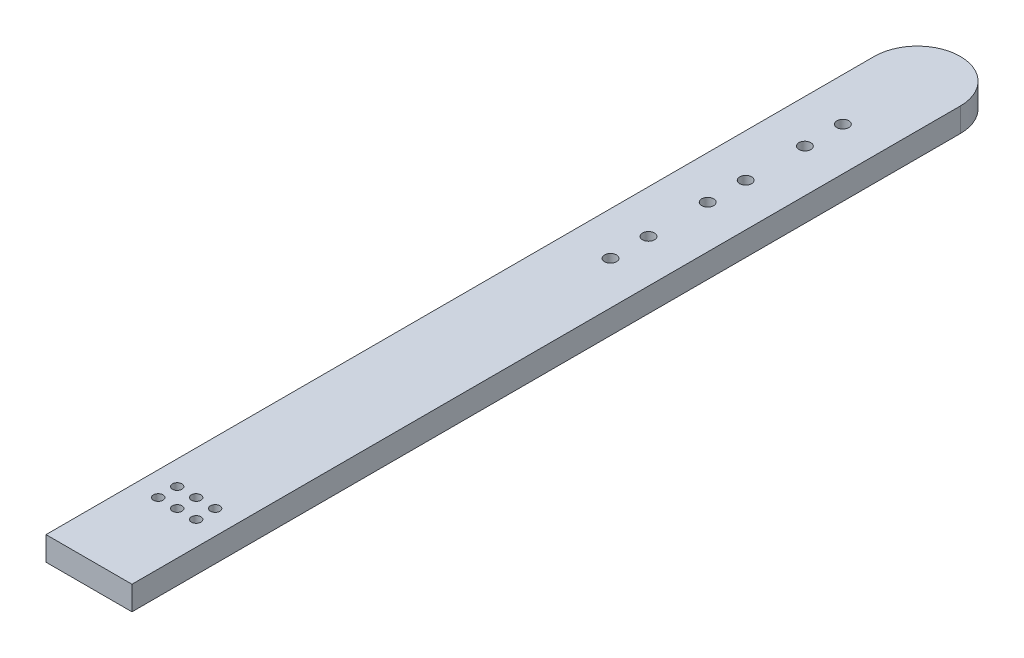
ISO-10303-21;
HEADER;
FILE_DESCRIPTION(('STEP AP214'),'2;1');
FILE_NAME('part.step','',(''),(''),'','','');
FILE_SCHEMA(('AUTOMOTIVE_DESIGN { 1 0 10303 214 1 1 1 1 }'));
ENDSEC;
DATA;
#1=APPLICATION_CONTEXT('core data for automotive mechanical design processes');
#2=APPLICATION_PROTOCOL_DEFINITION('international standard','automotive_design',2000,#1);
#3=PRODUCT_CONTEXT('',#1,'mechanical');
#4=PRODUCT('Part','Part','',(#3));
#5=PRODUCT_RELATED_PRODUCT_CATEGORY('part','',(#4));
#6=PRODUCT_DEFINITION_FORMATION('','',#4);
#7=PRODUCT_DEFINITION_CONTEXT('part definition',#1,'design');
#8=PRODUCT_DEFINITION('design','',#6,#7);
#9=PRODUCT_DEFINITION_SHAPE('','',#8);
#10=(LENGTH_UNIT() NAMED_UNIT(*) SI_UNIT(.MILLI.,.METRE.));
#11=(NAMED_UNIT(*) PLANE_ANGLE_UNIT() SI_UNIT($,.RADIAN.));
#12=(NAMED_UNIT(*) SI_UNIT($,.STERADIAN.) SOLID_ANGLE_UNIT());
#13=UNCERTAINTY_MEASURE_WITH_UNIT(LENGTH_MEASURE(1.E-05),#10,'distance_accuracy_value','');
#14=(GEOMETRIC_REPRESENTATION_CONTEXT(3) GLOBAL_UNCERTAINTY_ASSIGNED_CONTEXT((#13)) GLOBAL_UNIT_ASSIGNED_CONTEXT((#10,
#11,#12)) REPRESENTATION_CONTEXT('',''));
#15=CARTESIAN_POINT('',(0.,0.,0.));
#16=DIRECTION('',(0.,0.,1.));
#17=DIRECTION('',(1.,0.,0.));
#18=AXIS2_PLACEMENT_3D('',#15,#16,#17);
#19=CARTESIAN_POINT('',(2.875,1.6,0.));
#20=DIRECTION('',(-1.,0.,0.));
#21=DIRECTION('',(0.,0.,1.));
#22=AXIS2_PLACEMENT_3D('',#19,#20,#21);
#23=PLANE('',#22);
#24=DIRECTION('',(0.,0.,-1.));
#25=VECTOR('',#24,1.);
#26=CARTESIAN_POINT('',(2.875,0.,0.));
#27=LINE('',#26,#25);
#28=CARTESIAN_POINT('',(2.875,0.,20.1575));
#29=VERTEX_POINT('',#28);
#30=CARTESIAN_POINT('',(2.875,0.,-35.2425));
#31=VERTEX_POINT('',#30);
#32=EDGE_CURVE('E98',#29,#31,#27,.T.);
#33=ORIENTED_EDGE('',*,*,#32,.T.);
#34=DIRECTION('',(0.,-1.,0.));
#35=VECTOR('',#34,1.);
#36=CARTESIAN_POINT('',(2.875,1.6,-35.2425));
#37=LINE('',#36,#35);
#38=CARTESIAN_POINT('',(2.875,1.6,-35.2425));
#39=VERTEX_POINT('',#38);
#40=EDGE_CURVE('E11',#39,#31,#37,.T.);
#41=ORIENTED_EDGE('',*,*,#40,.F.);
#42=DIRECTION('',(0.,0.,-1.));
#43=VECTOR('',#42,1.);
#44=CARTESIAN_POINT('',(2.875,1.6,0.));
#45=LINE('',#44,#43);
#46=CARTESIAN_POINT('',(2.875,1.6,20.1575));
#47=VERTEX_POINT('',#46);
#48=EDGE_CURVE('E84',#47,#39,#45,.T.);
#49=ORIENTED_EDGE('',*,*,#48,.F.);
#50=DIRECTION('',(0.,-1.,0.));
#51=VECTOR('',#50,1.);
#52=CARTESIAN_POINT('',(2.875,1.6,20.1575));
#53=LINE('',#52,#51);
#54=EDGE_CURVE('E51',#47,#29,#53,.T.);
#55=ORIENTED_EDGE('',*,*,#54,.T.);
#56=EDGE_LOOP('',(#33,#41,#49,#55));
#57=FACE_BOUND('',#56,.T.);
#58=ADVANCED_FACE('F35',(#57),#23,.F.);
#59=CARTESIAN_POINT('',(0.,1.6,-35.2425));
#60=DIRECTION('',(0.,-1.,0.));
#61=DIRECTION('',(0.,0.,-1.));
#62=AXIS2_PLACEMENT_3D('',#59,#60,#61);
#63=CYLINDRICAL_SURFACE('',#62,2.875);
#64=CARTESIAN_POINT('',(0.,0.,-35.2425));
#65=DIRECTION('',(0.,1.,0.));
#66=DIRECTION('',(0.,0.,1.));
#67=AXIS2_PLACEMENT_3D('',#64,#65,#66);
#68=CIRCLE('',#67,2.875);
#69=CARTESIAN_POINT('',(-2.875,0.,-35.2425));
#70=VERTEX_POINT('',#69);
#71=EDGE_CURVE('E89',#31,#70,#68,.T.);
#72=ORIENTED_EDGE('',*,*,#71,.T.);
#73=DIRECTION('',(0.,-1.,0.));
#74=VECTOR('',#73,1.);
#75=CARTESIAN_POINT('',(-2.875,1.6,-35.2425));
#76=LINE('',#75,#74);
#77=CARTESIAN_POINT('',(-2.875,1.6,-35.2425));
#78=VERTEX_POINT('',#77);
#79=EDGE_CURVE('E43',#78,#70,#76,.T.);
#80=ORIENTED_EDGE('',*,*,#79,.F.);
#81=CARTESIAN_POINT('',(0.,1.6,-35.2425));
#82=DIRECTION('',(0.,1.,0.));
#83=DIRECTION('',(0.,0.,1.));
#84=AXIS2_PLACEMENT_3D('',#81,#82,#83);
#85=CIRCLE('',#84,2.875);
#86=EDGE_CURVE('E76',#39,#78,#85,.T.);
#87=ORIENTED_EDGE('',*,*,#86,.F.);
#88=ORIENTED_EDGE('',*,*,#40,.T.);
#89=EDGE_LOOP('',(#72,#80,#87,#88));
#90=FACE_BOUND('',#89,.T.);
#91=ADVANCED_FACE('F88',(#90),#63,.T.);
#92=CARTESIAN_POINT('',(-2.875,1.6,0.));
#93=DIRECTION('',(-1.,0.,0.));
#94=DIRECTION('',(0.,0.,1.));
#95=AXIS2_PLACEMENT_3D('',#92,#93,#94);
#96=PLANE('',#95);
#97=DIRECTION('',(0.,0.,-1.));
#98=VECTOR('',#97,1.);
#99=CARTESIAN_POINT('',(-2.875,0.,0.));
#100=LINE('',#99,#98);
#101=CARTESIAN_POINT('',(-2.875,0.,20.1575));
#102=VERTEX_POINT('',#101);
#103=EDGE_CURVE('E102',#102,#70,#100,.T.);
#104=ORIENTED_EDGE('',*,*,#103,.F.);
#105=DIRECTION('',(0.,-1.,0.));
#106=VECTOR('',#105,1.);
#107=CARTESIAN_POINT('',(-2.875,1.6,20.1575));
#108=LINE('',#107,#106);
#109=CARTESIAN_POINT('',(-2.875,1.6,20.1575));
#110=VERTEX_POINT('',#109);
#111=EDGE_CURVE('E65',#110,#102,#108,.T.);
#112=ORIENTED_EDGE('',*,*,#111,.F.);
#113=DIRECTION('',(0.,0.,-1.));
#114=VECTOR('',#113,1.);
#115=CARTESIAN_POINT('',(-2.875,1.6,0.));
#116=LINE('',#115,#114);
#117=EDGE_CURVE('E83',#110,#78,#116,.T.);
#118=ORIENTED_EDGE('',*,*,#117,.T.);
#119=ORIENTED_EDGE('',*,*,#79,.T.);
#120=EDGE_LOOP('',(#104,#112,#118,#119));
#121=FACE_BOUND('',#120,.T.);
#122=ADVANCED_FACE('F92',(#121),#96,.T.);
#123=CARTESIAN_POINT('',(0.,1.6,20.1575));
#124=DIRECTION('',(0.,0.,1.));
#125=DIRECTION('',(1.,0.,0.));
#126=AXIS2_PLACEMENT_3D('',#123,#124,#125);
#127=PLANE('',#126);
#128=DIRECTION('',(-1.,0.,0.));
#129=VECTOR('',#128,1.);
#130=CARTESIAN_POINT('',(0.,0.,20.1575));
#131=LINE('',#130,#129);
#132=EDGE_CURVE('E104',#29,#102,#131,.T.);
#133=ORIENTED_EDGE('',*,*,#132,.F.);
#134=ORIENTED_EDGE('',*,*,#54,.F.);
#135=DIRECTION('',(-1.,0.,0.));
#136=VECTOR('',#135,1.);
#137=CARTESIAN_POINT('',(0.,1.6,20.1575));
#138=LINE('',#137,#136);
#139=EDGE_CURVE('E93',#47,#110,#138,.T.);
#140=ORIENTED_EDGE('',*,*,#139,.T.);
#141=ORIENTED_EDGE('',*,*,#111,.T.);
#142=EDGE_LOOP('',(#133,#134,#140,#141));
#143=FACE_BOUND('',#142,.T.);
#144=ADVANCED_FACE('F195',(#143),#127,.T.);
#145=CARTESIAN_POINT('',(0.,1.6,0.));
#146=DIRECTION('',(0.,1.,0.));
#147=DIRECTION('',(0.,0.,1.));
#148=AXIS2_PLACEMENT_3D('',#145,#146,#147);
#149=PLANE('',#148);
#150=CARTESIAN_POINT('',(1.27000000000001,1.6,12.9889));
#151=DIRECTION('',(0.,-1.,0.));
#152=DIRECTION('',(0.,0.,-1.));
#153=AXIS2_PLACEMENT_3D('',#150,#151,#152);
#154=CIRCLE('',#153,0.317500000000002);
#155=CARTESIAN_POINT('',(1.27000000000001,1.6,12.6714));
#156=VERTEX_POINT('',#155);
#157=EDGE_CURVE('E147',#156,#156,#154,.T.);
#158=ORIENTED_EDGE('',*,*,#157,.T.);
#159=EDGE_LOOP('',(#158));
#160=FACE_BOUND('',#159,.T.);
#161=CARTESIAN_POINT('',(0.,1.6,12.9889));
#162=DIRECTION('',(0.,-1.,0.));
#163=DIRECTION('',(0.,0.,-1.));
#164=AXIS2_PLACEMENT_3D('',#161,#162,#163);
#165=CIRCLE('',#164,0.3175);
#166=CARTESIAN_POINT('',(0.,1.6,12.6714));
#167=VERTEX_POINT('',#166);
#168=EDGE_CURVE('E140',#167,#167,#165,.T.);
#169=ORIENTED_EDGE('',*,*,#168,.T.);
#170=EDGE_LOOP('',(#169));
#171=FACE_BOUND('',#170,.T.);
#172=CARTESIAN_POINT('',(0.,1.6,14.2589));
#173=DIRECTION('',(0.,-1.,0.));
#174=DIRECTION('',(0.,0.,-1.));
#175=AXIS2_PLACEMENT_3D('',#172,#173,#174);
#176=CIRCLE('',#175,0.317500000000002);
#177=CARTESIAN_POINT('',(0.,1.6,13.9414));
#178=VERTEX_POINT('',#177);
#179=EDGE_CURVE('E159',#178,#178,#176,.T.);
#180=ORIENTED_EDGE('',*,*,#179,.T.);
#181=EDGE_LOOP('',(#180));
#182=FACE_BOUND('',#181,.T.);
#183=CARTESIAN_POINT('',(-1.26999999999999,1.6,12.9889));
#184=DIRECTION('',(0.,-1.,0.));
#185=DIRECTION('',(0.,0.,-1.));
#186=AXIS2_PLACEMENT_3D('',#183,#184,#185);
#187=CIRCLE('',#186,0.3175);
#188=CARTESIAN_POINT('',(-1.26999999999999,1.6,12.6714));
#189=VERTEX_POINT('',#188);
#190=EDGE_CURVE('E152',#189,#189,#187,.T.);
#191=ORIENTED_EDGE('',*,*,#190,.T.);
#192=EDGE_LOOP('',(#191));
#193=FACE_BOUND('',#192,.T.);
#194=CARTESIAN_POINT('',(1.27,1.6,14.2589));
#195=DIRECTION('',(0.,-1.,0.));
#196=DIRECTION('',(0.,0.,-1.));
#197=AXIS2_PLACEMENT_3D('',#194,#195,#196);
#198=CIRCLE('',#197,0.317500000000002);
#199=CARTESIAN_POINT('',(1.27,1.6,13.9414));
#200=VERTEX_POINT('',#199);
#201=EDGE_CURVE('E116',#200,#200,#198,.T.);
#202=ORIENTED_EDGE('',*,*,#201,.T.);
#203=EDGE_LOOP('',(#202));
#204=FACE_BOUND('',#203,.T.);
#205=CARTESIAN_POINT('',(0.,1.6,-17.2625));
#206=DIRECTION('',(0.,-1.,0.));
#207=DIRECTION('',(0.,0.,-1.));
#208=AXIS2_PLACEMENT_3D('',#205,#206,#207);
#209=CIRCLE('',#208,0.400000000000002);
#210=CARTESIAN_POINT('',(0.,1.6,-17.6625));
#211=VERTEX_POINT('',#210);
#212=EDGE_CURVE('E123',#211,#211,#209,.T.);
#213=ORIENTED_EDGE('',*,*,#212,.T.);
#214=EDGE_LOOP('',(#213));
#215=FACE_BOUND('',#214,.T.);
#216=CARTESIAN_POINT('',(0.,1.6,-23.7625));
#217=DIRECTION('',(0.,-1.,0.));
#218=DIRECTION('',(0.,0.,-1.));
#219=AXIS2_PLACEMENT_3D('',#216,#217,#218);
#220=CIRCLE('',#219,0.4);
#221=CARTESIAN_POINT('',(0.,1.6,-24.1625));
#222=VERTEX_POINT('',#221);
#223=EDGE_CURVE('E129',#222,#222,#220,.T.);
#224=ORIENTED_EDGE('',*,*,#223,.T.);
#225=EDGE_LOOP('',(#224));
#226=FACE_BOUND('',#225,.T.);
#227=CARTESIAN_POINT('',(0.,1.6,-30.2625));
#228=DIRECTION('',(0.,-1.,0.));
#229=DIRECTION('',(0.,0.,-1.));
#230=AXIS2_PLACEMENT_3D('',#227,#228,#229);
#231=CIRCLE('',#230,0.400000000000001);
#232=CARTESIAN_POINT('',(0.,1.6,-30.6625));
#233=VERTEX_POINT('',#232);
#234=EDGE_CURVE('E135',#233,#233,#231,.T.);
#235=ORIENTED_EDGE('',*,*,#234,.T.);
#236=EDGE_LOOP('',(#235));
#237=FACE_BOUND('',#236,.T.);
#238=CARTESIAN_POINT('',(-1.27,1.6,14.2589));
#239=DIRECTION('',(0.,-1.,0.));
#240=DIRECTION('',(0.,0.,-1.));
#241=AXIS2_PLACEMENT_3D('',#238,#239,#240);
#242=CIRCLE('',#241,0.317500000000002);
#243=CARTESIAN_POINT('',(-1.27,1.6,13.9414));
#244=VERTEX_POINT('',#243);
#245=EDGE_CURVE('E176',#244,#244,#242,.T.);
#246=ORIENTED_EDGE('',*,*,#245,.T.);
#247=EDGE_LOOP('',(#246));
#248=FACE_BOUND('',#247,.T.);
#249=CARTESIAN_POINT('',(0.,1.6,-14.7225));
#250=DIRECTION('',(0.,-1.,0.));
#251=DIRECTION('',(0.,0.,-1.));
#252=AXIS2_PLACEMENT_3D('',#249,#250,#251);
#253=CIRCLE('',#252,0.400000000000001);
#254=CARTESIAN_POINT('',(0.,1.6,-15.1225));
#255=VERTEX_POINT('',#254);
#256=EDGE_CURVE('E170',#255,#255,#253,.T.);
#257=ORIENTED_EDGE('',*,*,#256,.T.);
#258=EDGE_LOOP('',(#257));
#259=FACE_BOUND('',#258,.T.);
#260=CARTESIAN_POINT('',(0.,1.6,-21.2225));
#261=DIRECTION('',(0.,-1.,0.));
#262=DIRECTION('',(0.,0.,-1.));
#263=AXIS2_PLACEMENT_3D('',#260,#261,#262);
#264=CIRCLE('',#263,0.400000000000001);
#265=CARTESIAN_POINT('',(0.,1.6,-21.6225));
#266=VERTEX_POINT('',#265);
#267=EDGE_CURVE('E164',#266,#266,#264,.T.);
#268=ORIENTED_EDGE('',*,*,#267,.T.);
#269=EDGE_LOOP('',(#268));
#270=FACE_BOUND('',#269,.T.);
#271=CARTESIAN_POINT('',(0.,1.6,-27.7225));
#272=DIRECTION('',(0.,-1.,0.));
#273=DIRECTION('',(0.,0.,-1.));
#274=AXIS2_PLACEMENT_3D('',#271,#272,#273);
#275=CIRCLE('',#274,0.400000000000001);
#276=CARTESIAN_POINT('',(0.,1.6,-28.1225));
#277=VERTEX_POINT('',#276);
#278=EDGE_CURVE('E100',#277,#277,#275,.T.);
#279=ORIENTED_EDGE('',*,*,#278,.T.);
#280=EDGE_LOOP('',(#279));
#281=FACE_BOUND('',#280,.T.);
#282=ORIENTED_EDGE('',*,*,#48,.T.);
#283=ORIENTED_EDGE('',*,*,#86,.T.);
#284=ORIENTED_EDGE('',*,*,#117,.F.);
#285=ORIENTED_EDGE('',*,*,#139,.F.);
#286=EDGE_LOOP('',(#282,#283,#284,#285));
#287=FACE_BOUND('',#286,.T.);
#288=ADVANCED_FACE('F80',(#160,#171,#182,#193,#204,#215,#226,#237,#248,#259,#270,#281,#287),
#149,.T.);
#289=CARTESIAN_POINT('',(0.,0.,0.));
#290=DIRECTION('',(0.,1.,0.));
#291=DIRECTION('',(0.,0.,1.));
#292=AXIS2_PLACEMENT_3D('',#289,#290,#291);
#293=PLANE('',#292);
#294=CARTESIAN_POINT('',(1.27000000000001,0.,12.9889));
#295=DIRECTION('',(0.,-1.,0.));
#296=DIRECTION('',(0.,0.,-1.));
#297=AXIS2_PLACEMENT_3D('',#294,#295,#296);
#298=CIRCLE('',#297,0.317500000000002);
#299=CARTESIAN_POINT('',(1.27000000000001,0.,12.6714));
#300=VERTEX_POINT('',#299);
#301=EDGE_CURVE('E120',#300,#300,#298,.T.);
#302=ORIENTED_EDGE('',*,*,#301,.F.);
#303=EDGE_LOOP('',(#302));
#304=FACE_BOUND('',#303,.T.);
#305=CARTESIAN_POINT('',(0.,0.,12.9889));
#306=DIRECTION('',(0.,-1.,0.));
#307=DIRECTION('',(0.,0.,-1.));
#308=AXIS2_PLACEMENT_3D('',#305,#306,#307);
#309=CIRCLE('',#308,0.3175);
#310=CARTESIAN_POINT('',(0.,0.,12.6714));
#311=VERTEX_POINT('',#310);
#312=EDGE_CURVE('E143',#311,#311,#309,.T.);
#313=ORIENTED_EDGE('',*,*,#312,.F.);
#314=EDGE_LOOP('',(#313));
#315=FACE_BOUND('',#314,.T.);
#316=CARTESIAN_POINT('',(0.,0.,14.2589));
#317=DIRECTION('',(0.,-1.,0.));
#318=DIRECTION('',(0.,0.,-1.));
#319=AXIS2_PLACEMENT_3D('',#316,#317,#318);
#320=CIRCLE('',#319,0.317500000000002);
#321=CARTESIAN_POINT('',(0.,0.,13.9414));
#322=VERTEX_POINT('',#321);
#323=EDGE_CURVE('E144',#322,#322,#320,.T.);
#324=ORIENTED_EDGE('',*,*,#323,.F.);
#325=EDGE_LOOP('',(#324));
#326=FACE_BOUND('',#325,.T.);
#327=CARTESIAN_POINT('',(-1.26999999999999,0.,12.9889));
#328=DIRECTION('',(0.,-1.,0.));
#329=DIRECTION('',(0.,0.,-1.));
#330=AXIS2_PLACEMENT_3D('',#327,#328,#329);
#331=CIRCLE('',#330,0.3175);
#332=CARTESIAN_POINT('',(-1.26999999999999,0.,12.6714));
#333=VERTEX_POINT('',#332);
#334=EDGE_CURVE('E155',#333,#333,#331,.T.);
#335=ORIENTED_EDGE('',*,*,#334,.F.);
#336=EDGE_LOOP('',(#335));
#337=FACE_BOUND('',#336,.T.);
#338=CARTESIAN_POINT('',(1.27,0.,14.2589));
#339=DIRECTION('',(0.,-1.,0.));
#340=DIRECTION('',(0.,0.,-1.));
#341=AXIS2_PLACEMENT_3D('',#338,#339,#340);
#342=CIRCLE('',#341,0.317500000000002);
#343=CARTESIAN_POINT('',(1.27,0.,13.9414));
#344=VERTEX_POINT('',#343);
#345=EDGE_CURVE('E119',#344,#344,#342,.T.);
#346=ORIENTED_EDGE('',*,*,#345,.F.);
#347=EDGE_LOOP('',(#346));
#348=FACE_BOUND('',#347,.T.);
#349=CARTESIAN_POINT('',(0.,0.,-17.2625));
#350=DIRECTION('',(0.,-1.,0.));
#351=DIRECTION('',(0.,0.,-1.));
#352=AXIS2_PLACEMENT_3D('',#349,#350,#351);
#353=CIRCLE('',#352,0.400000000000002);
#354=CARTESIAN_POINT('',(0.,0.,-17.6625));
#355=VERTEX_POINT('',#354);
#356=EDGE_CURVE('E126',#355,#355,#353,.T.);
#357=ORIENTED_EDGE('',*,*,#356,.F.);
#358=EDGE_LOOP('',(#357));
#359=FACE_BOUND('',#358,.T.);
#360=CARTESIAN_POINT('',(0.,0.,-23.7625));
#361=DIRECTION('',(0.,-1.,0.));
#362=DIRECTION('',(0.,0.,-1.));
#363=AXIS2_PLACEMENT_3D('',#360,#361,#362);
#364=CIRCLE('',#363,0.4);
#365=CARTESIAN_POINT('',(0.,0.,-24.1625));
#366=VERTEX_POINT('',#365);
#367=EDGE_CURVE('E132',#366,#366,#364,.T.);
#368=ORIENTED_EDGE('',*,*,#367,.F.);
#369=EDGE_LOOP('',(#368));
#370=FACE_BOUND('',#369,.T.);
#371=CARTESIAN_POINT('',(0.,0.,-30.2625));
#372=DIRECTION('',(0.,-1.,0.));
#373=DIRECTION('',(0.,0.,-1.));
#374=AXIS2_PLACEMENT_3D('',#371,#372,#373);
#375=CIRCLE('',#374,0.400000000000001);
#376=CARTESIAN_POINT('',(0.,0.,-30.6625));
#377=VERTEX_POINT('',#376);
#378=EDGE_CURVE('E113',#377,#377,#375,.T.);
#379=ORIENTED_EDGE('',*,*,#378,.F.);
#380=EDGE_LOOP('',(#379));
#381=FACE_BOUND('',#380,.T.);
#382=CARTESIAN_POINT('',(-1.27,0.,14.2589));
#383=DIRECTION('',(0.,-1.,0.));
#384=DIRECTION('',(0.,0.,-1.));
#385=AXIS2_PLACEMENT_3D('',#382,#383,#384);
#386=CIRCLE('',#385,0.317500000000002);
#387=CARTESIAN_POINT('',(-1.27,0.,13.9414));
#388=VERTEX_POINT('',#387);
#389=EDGE_CURVE('E156',#388,#388,#386,.T.);
#390=ORIENTED_EDGE('',*,*,#389,.F.);
#391=EDGE_LOOP('',(#390));
#392=FACE_BOUND('',#391,.T.);
#393=CARTESIAN_POINT('',(0.,0.,-14.7225));
#394=DIRECTION('',(0.,-1.,0.));
#395=DIRECTION('',(0.,0.,-1.));
#396=AXIS2_PLACEMENT_3D('',#393,#394,#395);
#397=CIRCLE('',#396,0.400000000000001);
#398=CARTESIAN_POINT('',(0.,0.,-15.1225));
#399=VERTEX_POINT('',#398);
#400=EDGE_CURVE('E173',#399,#399,#397,.T.);
#401=ORIENTED_EDGE('',*,*,#400,.F.);
#402=EDGE_LOOP('',(#401));
#403=FACE_BOUND('',#402,.T.);
#404=CARTESIAN_POINT('',(0.,0.,-21.2225));
#405=DIRECTION('',(0.,-1.,0.));
#406=DIRECTION('',(0.,0.,-1.));
#407=AXIS2_PLACEMENT_3D('',#404,#405,#406);
#408=CIRCLE('',#407,0.400000000000001);
#409=CARTESIAN_POINT('',(0.,0.,-21.6225));
#410=VERTEX_POINT('',#409);
#411=EDGE_CURVE('E167',#410,#410,#408,.T.);
#412=ORIENTED_EDGE('',*,*,#411,.F.);
#413=EDGE_LOOP('',(#412));
#414=FACE_BOUND('',#413,.T.);
#415=CARTESIAN_POINT('',(0.,0.,-27.7225));
#416=DIRECTION('',(0.,-1.,0.));
#417=DIRECTION('',(0.,0.,-1.));
#418=AXIS2_PLACEMENT_3D('',#415,#416,#417);
#419=CIRCLE('',#418,0.400000000000001);
#420=CARTESIAN_POINT('',(0.,0.,-28.1225));
#421=VERTEX_POINT('',#420);
#422=EDGE_CURVE('E110',#421,#421,#419,.T.);
#423=ORIENTED_EDGE('',*,*,#422,.F.);
#424=EDGE_LOOP('',(#423));
#425=FACE_BOUND('',#424,.T.);
#426=ORIENTED_EDGE('',*,*,#32,.F.);
#427=ORIENTED_EDGE('',*,*,#132,.T.);
#428=ORIENTED_EDGE('',*,*,#103,.T.);
#429=ORIENTED_EDGE('',*,*,#71,.F.);
#430=EDGE_LOOP('',(#426,#427,#428,#429));
#431=FACE_BOUND('',#430,.T.);
#432=ADVANCED_FACE('F184',(#304,#315,#326,#337,#348,#359,#370,#381,#392,#403,#414,#425,#431),
#293,.F.);
#433=CARTESIAN_POINT('',(0.,1.6,-27.7225));
#434=DIRECTION('',(0.,-1.,0.));
#435=DIRECTION('',(0.,0.,-1.));
#436=AXIS2_PLACEMENT_3D('',#433,#434,#435);
#437=CYLINDRICAL_SURFACE('',#436,0.400000000000001);
#438=ORIENTED_EDGE('',*,*,#278,.F.);
#439=EDGE_LOOP('',(#438));
#440=FACE_BOUND('',#439,.T.);
#441=ORIENTED_EDGE('',*,*,#422,.T.);
#442=EDGE_LOOP('',(#441));
#443=FACE_BOUND('',#442,.T.);
#444=ADVANCED_FACE('F187',(#440,#443),#437,.F.);
#445=CARTESIAN_POINT('',(0.,1.6,-21.2225));
#446=DIRECTION('',(0.,-1.,0.));
#447=DIRECTION('',(0.,0.,-1.));
#448=AXIS2_PLACEMENT_3D('',#445,#446,#447);
#449=CYLINDRICAL_SURFACE('',#448,0.400000000000001);
#450=ORIENTED_EDGE('',*,*,#267,.F.);
#451=EDGE_LOOP('',(#450));
#452=FACE_BOUND('',#451,.T.);
#453=ORIENTED_EDGE('',*,*,#411,.T.);
#454=EDGE_LOOP('',(#453));
#455=FACE_BOUND('',#454,.T.);
#456=ADVANCED_FACE('F243',(#452,#455),#449,.F.);
#457=CARTESIAN_POINT('',(0.,1.6,-14.7225));
#458=DIRECTION('',(0.,-1.,0.));
#459=DIRECTION('',(0.,0.,-1.));
#460=AXIS2_PLACEMENT_3D('',#457,#458,#459);
#461=CYLINDRICAL_SURFACE('',#460,0.400000000000001);
#462=ORIENTED_EDGE('',*,*,#256,.F.);
#463=EDGE_LOOP('',(#462));
#464=FACE_BOUND('',#463,.T.);
#465=ORIENTED_EDGE('',*,*,#400,.T.);
#466=EDGE_LOOP('',(#465));
#467=FACE_BOUND('',#466,.T.);
#468=ADVANCED_FACE('F253',(#464,#467),#461,.F.);
#469=CARTESIAN_POINT('',(-1.27,1.6,14.2589));
#470=DIRECTION('',(0.,-1.,0.));
#471=DIRECTION('',(0.,0.,-1.));
#472=AXIS2_PLACEMENT_3D('',#469,#470,#471);
#473=CYLINDRICAL_SURFACE('',#472,0.317500000000002);
#474=ORIENTED_EDGE('',*,*,#245,.F.);
#475=EDGE_LOOP('',(#474));
#476=FACE_BOUND('',#475,.T.);
#477=ORIENTED_EDGE('',*,*,#389,.T.);
#478=EDGE_LOOP('',(#477));
#479=FACE_BOUND('',#478,.T.);
#480=ADVANCED_FACE('F182',(#476,#479),#473,.F.);
#481=CARTESIAN_POINT('',(0.,1.6,-30.2625));
#482=DIRECTION('',(0.,-1.,0.));
#483=DIRECTION('',(0.,0.,-1.));
#484=AXIS2_PLACEMENT_3D('',#481,#482,#483);
#485=CYLINDRICAL_SURFACE('',#484,0.400000000000001);
#486=ORIENTED_EDGE('',*,*,#234,.F.);
#487=EDGE_LOOP('',(#486));
#488=FACE_BOUND('',#487,.T.);
#489=ORIENTED_EDGE('',*,*,#378,.T.);
#490=EDGE_LOOP('',(#489));
#491=FACE_BOUND('',#490,.T.);
#492=ADVANCED_FACE('F272',(#488,#491),#485,.F.);
#493=CARTESIAN_POINT('',(0.,1.6,-23.7625));
#494=DIRECTION('',(0.,-1.,0.));
#495=DIRECTION('',(0.,0.,-1.));
#496=AXIS2_PLACEMENT_3D('',#493,#494,#495);
#497=CYLINDRICAL_SURFACE('',#496,0.4);
#498=ORIENTED_EDGE('',*,*,#223,.F.);
#499=EDGE_LOOP('',(#498));
#500=FACE_BOUND('',#499,.T.);
#501=ORIENTED_EDGE('',*,*,#367,.T.);
#502=EDGE_LOOP('',(#501));
#503=FACE_BOUND('',#502,.T.);
#504=ADVANCED_FACE('F282',(#500,#503),#497,.F.);
#505=CARTESIAN_POINT('',(0.,1.6,-17.2625));
#506=DIRECTION('',(0.,-1.,0.));
#507=DIRECTION('',(0.,0.,-1.));
#508=AXIS2_PLACEMENT_3D('',#505,#506,#507);
#509=CYLINDRICAL_SURFACE('',#508,0.400000000000002);
#510=ORIENTED_EDGE('',*,*,#212,.F.);
#511=EDGE_LOOP('',(#510));
#512=FACE_BOUND('',#511,.T.);
#513=ORIENTED_EDGE('',*,*,#356,.T.);
#514=EDGE_LOOP('',(#513));
#515=FACE_BOUND('',#514,.T.);
#516=ADVANCED_FACE('F292',(#512,#515),#509,.F.);
#517=CARTESIAN_POINT('',(1.27,1.6,14.2589));
#518=DIRECTION('',(0.,-1.,0.));
#519=DIRECTION('',(0.,0.,-1.));
#520=AXIS2_PLACEMENT_3D('',#517,#518,#519);
#521=CYLINDRICAL_SURFACE('',#520,0.317500000000002);
#522=ORIENTED_EDGE('',*,*,#201,.F.);
#523=EDGE_LOOP('',(#522));
#524=FACE_BOUND('',#523,.T.);
#525=ORIENTED_EDGE('',*,*,#345,.T.);
#526=EDGE_LOOP('',(#525));
#527=FACE_BOUND('',#526,.T.);
#528=ADVANCED_FACE('F302',(#524,#527),#521,.F.);
#529=CARTESIAN_POINT('',(-1.26999999999999,1.6,12.9889));
#530=DIRECTION('',(0.,-1.,0.));
#531=DIRECTION('',(0.,0.,-1.));
#532=AXIS2_PLACEMENT_3D('',#529,#530,#531);
#533=CYLINDRICAL_SURFACE('',#532,0.3175);
#534=ORIENTED_EDGE('',*,*,#190,.F.);
#535=EDGE_LOOP('',(#534));
#536=FACE_BOUND('',#535,.T.);
#537=ORIENTED_EDGE('',*,*,#334,.T.);
#538=EDGE_LOOP('',(#537));
#539=FACE_BOUND('',#538,.T.);
#540=ADVANCED_FACE('F312',(#536,#539),#533,.F.);
#541=CARTESIAN_POINT('',(0.,1.6,14.2589));
#542=DIRECTION('',(0.,-1.,0.));
#543=DIRECTION('',(0.,0.,-1.));
#544=AXIS2_PLACEMENT_3D('',#541,#542,#543);
#545=CYLINDRICAL_SURFACE('',#544,0.317500000000002);
#546=ORIENTED_EDGE('',*,*,#179,.F.);
#547=EDGE_LOOP('',(#546));
#548=FACE_BOUND('',#547,.T.);
#549=ORIENTED_EDGE('',*,*,#323,.T.);
#550=EDGE_LOOP('',(#549));
#551=FACE_BOUND('',#550,.T.);
#552=ADVANCED_FACE('F322',(#548,#551),#545,.F.);
#553=CARTESIAN_POINT('',(0.,1.6,12.9889));
#554=DIRECTION('',(0.,-1.,0.));
#555=DIRECTION('',(0.,0.,-1.));
#556=AXIS2_PLACEMENT_3D('',#553,#554,#555);
#557=CYLINDRICAL_SURFACE('',#556,0.3175);
#558=ORIENTED_EDGE('',*,*,#168,.F.);
#559=EDGE_LOOP('',(#558));
#560=FACE_BOUND('',#559,.T.);
#561=ORIENTED_EDGE('',*,*,#312,.T.);
#562=EDGE_LOOP('',(#561));
#563=FACE_BOUND('',#562,.T.);
#564=ADVANCED_FACE('F332',(#560,#563),#557,.F.);
#565=CARTESIAN_POINT('',(1.27000000000001,1.6,12.9889));
#566=DIRECTION('',(0.,-1.,0.));
#567=DIRECTION('',(0.,0.,-1.));
#568=AXIS2_PLACEMENT_3D('',#565,#566,#567);
#569=CYLINDRICAL_SURFACE('',#568,0.317500000000002);
#570=ORIENTED_EDGE('',*,*,#157,.F.);
#571=EDGE_LOOP('',(#570));
#572=FACE_BOUND('',#571,.T.);
#573=ORIENTED_EDGE('',*,*,#301,.T.);
#574=EDGE_LOOP('',(#573));
#575=FACE_BOUND('',#574,.T.);
#576=ADVANCED_FACE('F342',(#572,#575),#569,.F.);
#577=CLOSED_SHELL('',(#58,#91,#122,#144,#288,#432,#444,#456,#468,#480,#492,#504,#516,#528,#540,
#552,#564,#576));
#578=MANIFOLD_SOLID_BREP('B2',#577);
#579=ADVANCED_BREP_SHAPE_REPRESENTATION('',(#18,#578),#14);
#580=SHAPE_DEFINITION_REPRESENTATION(#9,#579);
ENDSEC;
END-ISO-10303-21;
